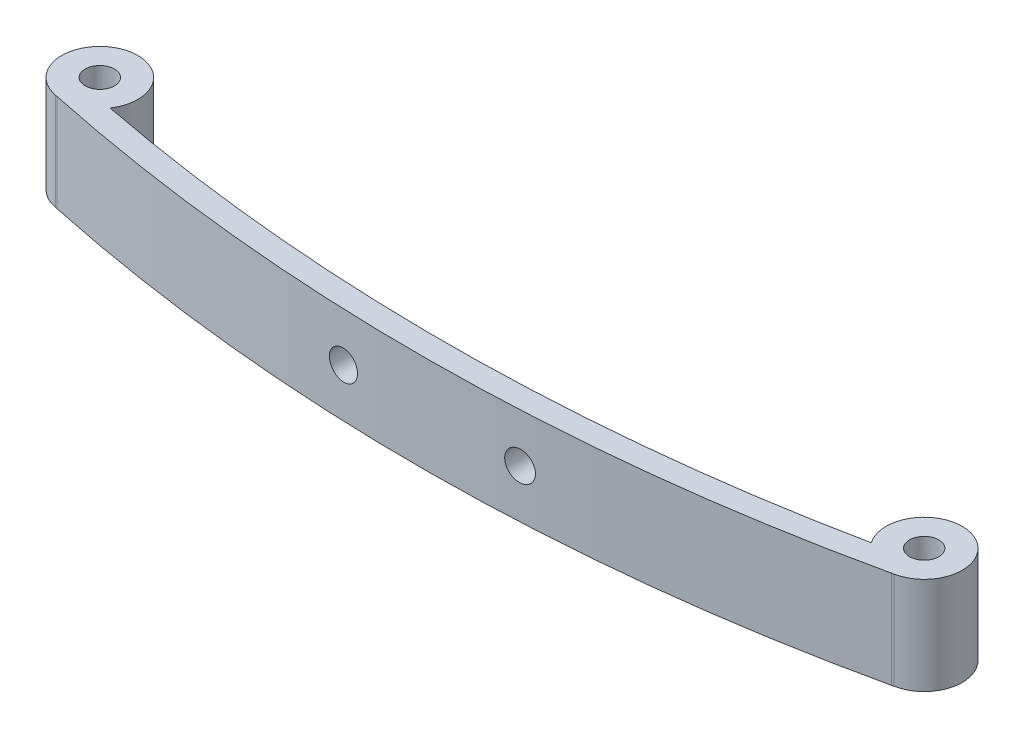
ISO-10303-21;
HEADER;
FILE_DESCRIPTION(('STEP AP214'),'2;1');
FILE_NAME('part.step','',(''),(''),'','','');
FILE_SCHEMA(('AUTOMOTIVE_DESIGN { 1 0 10303 214 1 1 1 1 }'));
ENDSEC;
DATA;
#1=APPLICATION_CONTEXT('core data for automotive mechanical design processes');
#2=APPLICATION_PROTOCOL_DEFINITION('international standard','automotive_design',2000,#1);
#3=PRODUCT_CONTEXT('',#1,'mechanical');
#4=PRODUCT('Part','Part','',(#3));
#5=PRODUCT_RELATED_PRODUCT_CATEGORY('part','',(#4));
#6=PRODUCT_DEFINITION_FORMATION('','',#4);
#7=PRODUCT_DEFINITION_CONTEXT('part definition',#1,'design');
#8=PRODUCT_DEFINITION('design','',#6,#7);
#9=PRODUCT_DEFINITION_SHAPE('','',#8);
#10=(LENGTH_UNIT() NAMED_UNIT(*) SI_UNIT(.MILLI.,.METRE.));
#11=(NAMED_UNIT(*) PLANE_ANGLE_UNIT() SI_UNIT($,.RADIAN.));
#12=(NAMED_UNIT(*) SI_UNIT($,.STERADIAN.) SOLID_ANGLE_UNIT());
#13=UNCERTAINTY_MEASURE_WITH_UNIT(LENGTH_MEASURE(1.E-05),#10,'distance_accuracy_value','');
#14=(GEOMETRIC_REPRESENTATION_CONTEXT(3) GLOBAL_UNCERTAINTY_ASSIGNED_CONTEXT((#13)) GLOBAL_UNIT_ASSIGNED_CONTEXT((#10,
#11,#12)) REPRESENTATION_CONTEXT('',''));
#15=CARTESIAN_POINT('',(0.,0.,0.));
#16=DIRECTION('',(0.,0.,1.));
#17=DIRECTION('',(1.,0.,0.));
#18=AXIS2_PLACEMENT_3D('',#15,#16,#17);
#19=CARTESIAN_POINT('',(-0.864955357142889,8.3,-164.510629845203));
#20=DIRECTION('',(0.,1.,0.));
#21=DIRECTION('',(0.,0.,1.));
#22=AXIS2_PLACEMENT_3D('',#19,#20,#21);
#23=PLANE('',#22);
#24=CARTESIAN_POINT('',(-35.,8.3,-4.14258073909656));
#25=DIRECTION('',(0.,1.,0.));
#26=DIRECTION('',(0.,0.,1.));
#27=AXIS2_PLACEMENT_3D('',#24,#25,#26);
#28=CIRCLE('',#27,1.25);
#29=CARTESIAN_POINT('',(-35.,8.3,-2.89258073909657));
#30=VERTEX_POINT('',#29);
#31=EDGE_CURVE('E136',#30,#30,#28,.T.);
#32=ORIENTED_EDGE('',*,*,#31,.F.);
#33=EDGE_LOOP('',(#32));
#34=FACE_BOUND('',#33,.T.);
#35=CARTESIAN_POINT('',(-0.864955357142889,8.3,-164.510629845203));
#36=DIRECTION('',(0.,-1.,0.));
#37=DIRECTION('',(0.,0.,1.));
#38=AXIS2_PLACEMENT_3D('',#35,#36,#37);
#39=CIRCLE('',#38,165.210703971618);
#40=CARTESIAN_POINT('',(32.3290587197964,8.3,-2.66893516717083));
#41=VERTEX_POINT('',#40);
#42=CARTESIAN_POINT('',(-32.3092176120712,8.3,-2.31989312438794));
#43=VERTEX_POINT('',#42);
#44=EDGE_CURVE('E143',#41,#43,#39,.T.);
#45=ORIENTED_EDGE('',*,*,#44,.T.);
#46=CARTESIAN_POINT('',(-35.,8.3,-4.14258073909656));
#47=DIRECTION('',(0.,1.,0.));
#48=DIRECTION('',(0.,0.,1.));
#49=AXIS2_PLACEMENT_3D('',#46,#47,#48);
#50=CIRCLE('',#49,3.25);
#51=CARTESIAN_POINT('',(-35.5757158370828,8.3,-0.943979283001734));
#52=VERTEX_POINT('',#51);
#53=EDGE_CURVE('E101',#43,#52,#50,.T.);
#54=ORIENTED_EDGE('',*,*,#53,.T.);
#55=DIRECTION('',(0.97628943196104,0.,0.216469270431603));
#56=VECTOR('',#55,1.);
#57=CARTESIAN_POINT('',(-35.413230424207,8.3,-0.907951955828518));
#58=LINE('',#57,#56);
#59=CARTESIAN_POINT('',(-35.413230424207,8.3,-0.907951955828545));
#60=VERTEX_POINT('',#59);
#61=EDGE_CURVE('E114',#52,#60,#58,.T.);
#62=ORIENTED_EDGE('',*,*,#61,.T.);
#63=CARTESIAN_POINT('',(-0.864955357142889,8.3,-164.510629845203));
#64=DIRECTION('',(0.,1.,0.));
#65=DIRECTION('',(0.,0.,1.));
#66=AXIS2_PLACEMENT_3D('',#63,#64,#65);
#67=CIRCLE('',#66,167.210703971618);
#68=CARTESIAN_POINT('',(35.4341722962853,8.3,-1.28749161325972));
#69=VERTEX_POINT('',#68);
#70=EDGE_CURVE('E108',#60,#69,#67,.T.);
#71=ORIENTED_EDGE('',*,*,#70,.T.);
#72=DIRECTION('',(0.974629450610067,0.,-0.223824560769186));
#73=VECTOR('',#72,1.);
#74=CARTESIAN_POINT('',(35.4341722962853,8.3,-1.28749161325972));
#75=LINE('',#74,#73);
#76=CARTESIAN_POINT('',(35.6227279714257,8.3,-1.33079359961198));
#77=VERTEX_POINT('',#76);
#78=EDGE_CURVE('E112',#69,#77,#75,.T.);
#79=ORIENTED_EDGE('',*,*,#78,.T.);
#80=CARTESIAN_POINT('',(35.,8.3,-4.52057570402037));
#81=DIRECTION('',(0.,1.,0.));
#82=DIRECTION('',(0.,0.,1.));
#83=AXIS2_PLACEMENT_3D('',#80,#81,#82);
#84=CIRCLE('',#83,3.25);
#85=EDGE_CURVE('E64',#77,#41,#84,.T.);
#86=ORIENTED_EDGE('',*,*,#85,.T.);
#87=EDGE_LOOP('',(#45,#54,#62,#71,#79,#86));
#88=FACE_BOUND('',#87,.T.);
#89=CARTESIAN_POINT('',(35.,8.3,-4.52057570402037));
#90=DIRECTION('',(0.,1.,0.));
#91=DIRECTION('',(0.,0.,1.));
#92=AXIS2_PLACEMENT_3D('',#89,#90,#91);
#93=CIRCLE('',#92,1.25);
#94=CARTESIAN_POINT('',(35.,8.3,-3.27057570402038));
#95=VERTEX_POINT('',#94);
#96=EDGE_CURVE('E181',#95,#95,#93,.T.);
#97=ORIENTED_EDGE('',*,*,#96,.F.);
#98=EDGE_LOOP('',(#97));
#99=FACE_BOUND('',#98,.T.);
#100=ADVANCED_FACE('F39',(#34,#88,#99),#23,.T.);
#101=CARTESIAN_POINT('',(-0.864955357142889,0.,-164.510629845203));
#102=DIRECTION('',(0.,1.,0.));
#103=DIRECTION('',(0.,0.,1.));
#104=AXIS2_PLACEMENT_3D('',#101,#102,#103);
#105=PLANE('',#104);
#106=CARTESIAN_POINT('',(-0.864955357142889,0.,-164.510629845203));
#107=DIRECTION('',(0.,-1.,0.));
#108=DIRECTION('',(0.,0.,1.));
#109=AXIS2_PLACEMENT_3D('',#106,#107,#108);
#110=CIRCLE('',#109,165.210703971618);
#111=CARTESIAN_POINT('',(32.3290587197964,0.,-2.66893516717083));
#112=VERTEX_POINT('',#111);
#113=CARTESIAN_POINT('',(-32.3092176120712,0.,-2.31989312438794));
#114=VERTEX_POINT('',#113);
#115=EDGE_CURVE('E132',#112,#114,#110,.T.);
#116=ORIENTED_EDGE('',*,*,#115,.F.);
#117=CARTESIAN_POINT('',(35.,0.,-4.52057570402037));
#118=DIRECTION('',(0.,1.,0.));
#119=DIRECTION('',(0.,0.,1.));
#120=AXIS2_PLACEMENT_3D('',#117,#118,#119);
#121=CIRCLE('',#120,3.25);
#122=CARTESIAN_POINT('',(35.6227279714257,0.,-1.33079359961198));
#123=VERTEX_POINT('',#122);
#124=EDGE_CURVE('E93',#123,#112,#121,.T.);
#125=ORIENTED_EDGE('',*,*,#124,.F.);
#126=DIRECTION('',(0.974629450610067,0.,-0.223824560769186));
#127=VECTOR('',#126,1.);
#128=CARTESIAN_POINT('',(35.4341722962853,0.,-1.28749161325972));
#129=LINE('',#128,#127);
#130=CARTESIAN_POINT('',(35.4341722962853,0.,-1.28749161325972));
#131=VERTEX_POINT('',#130);
#132=EDGE_CURVE('E87',#131,#123,#129,.T.);
#133=ORIENTED_EDGE('',*,*,#132,.F.);
#134=CARTESIAN_POINT('',(-0.864955357142889,0.,-164.510629845203));
#135=DIRECTION('',(0.,1.,0.));
#136=DIRECTION('',(0.,0.,1.));
#137=AXIS2_PLACEMENT_3D('',#134,#135,#136);
#138=CIRCLE('',#137,167.210703971618);
#139=CARTESIAN_POINT('',(-35.413230424207,0.,-0.907951955828545));
#140=VERTEX_POINT('',#139);
#141=EDGE_CURVE('E122',#140,#131,#138,.T.);
#142=ORIENTED_EDGE('',*,*,#141,.F.);
#143=DIRECTION('',(0.97628943196104,0.,0.216469270431603));
#144=VECTOR('',#143,1.);
#145=CARTESIAN_POINT('',(-35.413230424207,0.,-0.907951955828518));
#146=LINE('',#145,#144);
#147=CARTESIAN_POINT('',(-35.5757158370828,0.,-0.943979283001734));
#148=VERTEX_POINT('',#147);
#149=EDGE_CURVE('E138',#148,#140,#146,.T.);
#150=ORIENTED_EDGE('',*,*,#149,.F.);
#151=CARTESIAN_POINT('',(-35.,0.,-4.14258073909656));
#152=DIRECTION('',(0.,1.,0.));
#153=DIRECTION('',(0.,0.,1.));
#154=AXIS2_PLACEMENT_3D('',#151,#152,#153);
#155=CIRCLE('',#154,3.25);
#156=EDGE_CURVE('E135',#114,#148,#155,.T.);
#157=ORIENTED_EDGE('',*,*,#156,.F.);
#158=EDGE_LOOP('',(#116,#125,#133,#142,#150,#157));
#159=FACE_BOUND('',#158,.T.);
#160=CARTESIAN_POINT('',(-35.,0.,-4.14258073909656));
#161=DIRECTION('',(0.,1.,0.));
#162=DIRECTION('',(0.,0.,1.));
#163=AXIS2_PLACEMENT_3D('',#160,#161,#162);
#164=CIRCLE('',#163,1.25);
#165=CARTESIAN_POINT('',(-35.,0.,-2.89258073909657));
#166=VERTEX_POINT('',#165);
#167=EDGE_CURVE('E184',#166,#166,#164,.T.);
#168=ORIENTED_EDGE('',*,*,#167,.T.);
#169=EDGE_LOOP('',(#168));
#170=FACE_BOUND('',#169,.T.);
#171=CARTESIAN_POINT('',(35.,0.,-4.52057570402037));
#172=DIRECTION('',(0.,1.,0.));
#173=DIRECTION('',(0.,0.,1.));
#174=AXIS2_PLACEMENT_3D('',#171,#172,#173);
#175=CIRCLE('',#174,1.25);
#176=CARTESIAN_POINT('',(35.,0.,-3.27057570402038));
#177=VERTEX_POINT('',#176);
#178=EDGE_CURVE('E180',#177,#177,#175,.T.);
#179=ORIENTED_EDGE('',*,*,#178,.T.);
#180=EDGE_LOOP('',(#179));
#181=FACE_BOUND('',#180,.T.);
#182=ADVANCED_FACE('F200',(#159,#170,#181),#105,.F.);
#183=CARTESIAN_POINT('',(-0.864955357142889,8.3,-164.510629845203));
#184=DIRECTION('',(0.,-1.,0.));
#185=DIRECTION('',(0.,0.,-1.));
#186=AXIS2_PLACEMENT_3D('',#183,#184,#185);
#187=CYLINDRICAL_SURFACE('',#186,165.210703971618);
#188=CARTESIAN_POINT('',(8.75523546801958,4.15,0.41974526891872));
#189=CARTESIAN_POINT('',(8.75523234367771,4.22012775691496,0.419745491554456));
#190=CARTESIAN_POINT('',(8.7493140129362,4.2903063866926,0.420090990830751));
#191=CARTESIAN_POINT('',(8.72578859372263,4.42872911081155,0.421460636690887));
#192=CARTESIAN_POINT('',(8.70816743840692,4.49697077385119,0.422485599990574));
#193=CARTESIAN_POINT('',(8.66174382480419,4.62949238087325,0.425173566201312));
#194=CARTESIAN_POINT('',(8.63294714461795,4.69377435227299,0.426836239390938));
#195=CARTESIAN_POINT('',(8.56500291570541,4.81657067320099,0.430734724263326));
#196=CARTESIAN_POINT('',(8.52585789764512,4.87508642805016,0.432970395816375));
#197=CARTESIAN_POINT('',(8.43828867001005,4.98476982495955,0.437932672337795));
#198=CARTESIAN_POINT('',(8.38985599940334,5.03593069179741,0.440659724815337));
#199=CARTESIAN_POINT('',(8.28510948695568,5.12939981296102,0.446503270882601));
#200=CARTESIAN_POINT('',(8.22879527493013,5.1717076512398,0.449619782763931));
#201=CARTESIAN_POINT('',(8.10979143930163,5.24633590146088,0.45613704390323));
#202=CARTESIAN_POINT('',(8.04709214420073,5.27864085376892,0.459538222916373));
#203=CARTESIAN_POINT('',(7.91716826779515,5.33226495035966,0.466505660058124));
#204=CARTESIAN_POINT('',(7.84994366214295,5.35358403552979,0.470071919074879));
#205=CARTESIAN_POINT('',(7.71279154477582,5.38465389005854,0.477259659800095));
#206=CARTESIAN_POINT('',(7.6428609508304,5.39439104119409,0.480881201455498));
#207=CARTESIAN_POINT('',(7.50235497855954,5.40197507513718,0.488066429431124));
#208=CARTESIAN_POINT('',(7.4317795997323,5.39982194869035,0.491630115706314));
#209=CARTESIAN_POINT('',(7.29196756282965,5.38368151981341,0.498600856959138));
#210=CARTESIAN_POINT('',(7.2227312745681,5.36969099469107,0.502007869016394));
#211=CARTESIAN_POINT('',(7.08758566731119,5.33026408498481,0.508576243457887));
#212=CARTESIAN_POINT('',(7.02167634432059,5.30482771414616,0.511737606137118));
#213=CARTESIAN_POINT('',(6.89509912252421,5.24324484304104,0.517738255939391));
#214=CARTESIAN_POINT('',(6.83442816188194,5.2071046546717,0.520577731514248));
#215=CARTESIAN_POINT('',(6.72001377975751,5.12513046151643,0.525875920481087));
#216=CARTESIAN_POINT('',(6.6662703199565,5.07929651035439,0.528334635979225));
#217=CARTESIAN_POINT('',(6.56729686844673,4.97928617943602,0.532821376474635));
#218=CARTESIAN_POINT('',(6.52205816339034,4.92511844250437,0.534849842550244));
#219=CARTESIAN_POINT('',(6.44131745101904,4.80994279108891,0.53844383631376));
#220=CARTESIAN_POINT('',(6.40581539141347,4.74893491334256,0.54000936648787));
#221=CARTESIAN_POINT('',(6.34559332504817,4.62187687823517,0.54265126930583));
#222=CARTESIAN_POINT('',(6.32086252862733,4.55583184494836,0.543728131497863));
#223=CARTESIAN_POINT('',(6.28283757600977,4.42052173500274,0.545379219315388));
#224=CARTESIAN_POINT('',(6.26954337213898,4.35125667176806,0.545953447036141));
#225=CARTESIAN_POINT('',(6.25477644190879,4.21152194369805,0.546591086545572));
#226=CARTESIAN_POINT('',(6.25329588598813,4.14105310771492,0.546654836656242));
#227=CARTESIAN_POINT('',(6.26217788761156,4.00086729392074,0.546271547983102));
#228=CARTESIAN_POINT('',(6.27254042347998,3.93115031473385,0.545824510134156));
#229=CARTESIAN_POINT('',(6.30480977715857,3.79446002038941,0.544425917333555));
#230=CARTESIAN_POINT('',(6.32671451735362,3.72748621379392,0.543474453179248));
#231=CARTESIAN_POINT('',(6.38144211469525,3.59816844412159,0.541080768086543));
#232=CARTESIAN_POINT('',(6.4142649785184,3.53582448387598,0.539638546848042));
#233=CARTESIAN_POINT('',(6.48990602173823,3.41751275913382,0.536285149030597));
#234=CARTESIAN_POINT('',(6.53272751484578,3.36154711768794,0.534373816969817));
#235=CARTESIAN_POINT('',(6.62714041042641,3.257599379909,0.530114926661906));
#236=CARTESIAN_POINT('',(6.67873184655798,3.20961731421781,0.527767366740558));
#237=CARTESIAN_POINT('',(6.78926149618302,3.12295724190971,0.522678091077079));
#238=CARTESIAN_POINT('',(6.84820545871927,3.08428658612228,0.519936066637596));
#239=CARTESIAN_POINT('',(6.97173301782925,3.01738849182913,0.514116300395867));
#240=CARTESIAN_POINT('',(7.0363166398803,2.98916110050416,0.511038557076984));
#241=CARTESIAN_POINT('',(7.16936208213937,2.94391906611331,0.504614561530486));
#242=CARTESIAN_POINT('',(7.23782791441387,2.92691626117345,0.501268029980191));
#243=CARTESIAN_POINT('',(7.37663371301743,2.90464766967319,0.494393542668509));
#244=CARTESIAN_POINT('',(7.44697369404434,2.89938197518744,0.490865585484106));
#245=CARTESIAN_POINT('',(7.58760200130654,2.90073423451941,0.483721398905784));
#246=CARTESIAN_POINT('',(7.65789021504032,2.90736347919335,0.480105088860304));
#247=CARTESIAN_POINT('',(7.79635468897041,2.93233884260768,0.472894251458949));
#248=CARTESIAN_POINT('',(7.86453093753108,2.95068502588915,0.469299724223171));
#249=CARTESIAN_POINT('',(7.99686289087432,2.99858525081672,0.462244531146737));
#250=CARTESIAN_POINT('',(8.06101703624891,3.02814360859774,0.458783917422253));
#251=CARTESIAN_POINT('',(8.18344997043051,3.09763154156223,0.452113922680006));
#252=CARTESIAN_POINT('',(8.24172899851644,3.13756069413193,0.448904531431768));
#253=CARTESIAN_POINT('',(8.35071784684562,3.22663140626683,0.442851648466624));
#254=CARTESIAN_POINT('',(8.4014326748975,3.27576682185215,0.44000791484301));
#255=CARTESIAN_POINT('',(8.49390354221656,3.38189250945195,0.434787242240552));
#256=CARTESIAN_POINT('',(8.535657411412,3.43888467865759,0.432410416344335));
#257=CARTESIAN_POINT('',(8.60896038366011,3.55903345604726,0.428216332520746));
#258=CARTESIAN_POINT('',(8.64051852487354,3.62218453954559,0.426398579064002));
#259=CARTESIAN_POINT('',(8.69254686909989,3.75285329662178,0.423391944263031));
#260=CARTESIAN_POINT('',(8.71303050005948,3.82036557046379,0.422202301370124));
#261=CARTESIAN_POINT('',(8.73684790490841,3.93192653704009,0.420817000107771));
#262=CARTESIAN_POINT('',(8.74373455060982,3.97524634074798,0.420415766646807));
#263=CARTESIAN_POINT('',(8.75292930616206,4.06237080749051,0.419879831617554));
#264=CARTESIAN_POINT('',(8.75523742049632,4.10617547005032,0.419745129788268));
#265=CARTESIAN_POINT('',(8.75523546801958,4.15,0.41974526891872));
#266=B_SPLINE_CURVE_WITH_KNOTS('',3,(#188,#189,#190,#191,#192,#193,#194,#195,#196,#197,#198,
#199,#200,#201,#202,#203,#204,#205,#206,#207,#208,#209,#210,#211,#212,#213,#214,#215,#216,#217,
#218,#219,#220,#221,#222,#223,#224,#225,#226,#227,#228,#229,#230,#231,#232,#233,#234,#235,#236,
#237,#238,#239,#240,#241,#242,#243,#244,#245,#246,#247,#248,#249,#250,#251,#252,#253,#254,#255,
#256,#257,#258,#259,#260,#261,#262,#263,#264,#265),.UNSPECIFIED.,.T.,.F.,(4,2,2,2,2,2,2,2,2,2,2,
2,2,2,2,2,2,2,2,2,2,2,2,2,2,2,2,2,2,2,2,2,2,2,2,2,2,2,4),(0.,0.210223162273476,
0.420699472105275,0.631067103680404,0.841383337771128,1.05189208761873,1.26241072807794,
1.4732531232293,1.68409665286589,1.89518785139276,2.10627921421473,2.31742806445294,
2.52857666112368,2.73960099337464,2.95062415831329,3.16142993192407,3.37223457337985,
3.58282756172663,3.7934196722006,4.00387219997306,4.2143243425681,4.42473861637718,
4.63515301885741,4.8456372553737,5.05612229973341,5.26677296926159,5.47742459045928,
5.68829802413861,5.89917311206057,6.11024847170822,6.32132499404439,6.53248285304027,
6.74363210862383,6.95464094832168,7.16570083042665,7.37657309857563,7.58718910542907,
7.71856276827032,7.84993630246649),.UNSPECIFIED.);
#267=CARTESIAN_POINT('',(8.75523546801958,4.15,0.41974526891872));
#268=VERTEX_POINT('',#267);
#269=EDGE_CURVE('E174',#268,#268,#266,.T.);
#270=ORIENTED_EDGE('',*,*,#269,.T.);
#271=EDGE_LOOP('',(#270));
#272=FACE_BOUND('',#271,.T.);
#273=CARTESIAN_POINT('',(-6.24476453198042,4.15,0.61245866769935));
#274=CARTESIAN_POINT('',(-6.24476764768577,4.22018360799957,0.612458606573658));
#275=CARTESIAN_POINT('',(-6.2506953010656,4.29041808996733,0.612265770116205));
#276=CARTESIAN_POINT('',(-6.27425905692377,4.42895231746688,0.611495485977878));
#277=CARTESIAN_POINT('',(-6.29190924491371,4.497249632279,0.610917575598852));
#278=CARTESIAN_POINT('',(-6.33841377636479,4.6298820691541,0.609382563660205));
#279=CARTESIAN_POINT('',(-6.36726266776337,4.69421910163959,0.608425646614495));
#280=CARTESIAN_POINT('',(-6.43533606625281,4.81711723970539,0.60614313592235));
#281=CARTESIAN_POINT('',(-6.47455800057068,4.87567977256776,0.604817633690034));
#282=CARTESIAN_POINT('',(-6.56227848115715,4.98540692572473,0.601814073459906));
#283=CARTESIAN_POINT('',(-6.61077985440873,5.03656928319194,0.600135908007802));
#284=CARTESIAN_POINT('',(-6.71567453205909,5.13002724983261,0.596452196119219));
#285=CARTESIAN_POINT('',(-6.77206816300177,5.17232249194623,0.594446636136147));
#286=CARTESIAN_POINT('',(-6.89117358777328,5.24686649539246,0.590142255155237));
#287=CARTESIAN_POINT('',(-6.95388849684398,5.27911027082593,0.587843289411626));
#288=CARTESIAN_POINT('',(-7.08383208059165,5.33261216168597,0.582999656758561));
#289=CARTESIAN_POINT('',(-7.15106076259404,5.35387025928335,0.580454989450354));
#290=CARTESIAN_POINT('',(-7.28817028578425,5.38481219158038,0.5751773096252));
#291=CARTESIAN_POINT('',(-7.35805284066948,5.39448841169088,0.572444174445956));
#292=CARTESIAN_POINT('',(-7.49844585803743,5.40196966364717,0.566862398106028));
#293=CARTESIAN_POINT('',(-7.568956321709,5.39977467301157,0.564013756726611));
#294=CARTESIAN_POINT('',(-7.70864507353955,5.38357273188965,0.558281547366208));
#295=CARTESIAN_POINT('',(-7.77782260448696,5.369559258806,0.555397960965485));
#296=CARTESIAN_POINT('',(-7.91284266673113,5.33010905553934,0.549688100359515));
#297=CARTESIAN_POINT('',(-7.97868518865661,5.30467229325921,0.546861826315328));
#298=CARTESIAN_POINT('',(-8.10517373868071,5.24309151777392,0.541361833708983));
#299=CARTESIAN_POINT('',(-8.16581913996236,5.20694621536436,0.538688133561491));
#300=CARTESIAN_POINT('',(-8.28018042223605,5.12497250539288,0.533589762293989));
#301=CARTESIAN_POINT('',(-8.333896319487,5.07914412055134,0.531165090589679));
#302=CARTESIAN_POINT('',(-8.43284346162954,4.97912834642317,0.526657559583951));
#303=CARTESIAN_POINT('',(-8.47807903111339,4.92494524350744,0.524574526130325));
#304=CARTESIAN_POINT('',(-8.55880935877245,4.80973931783301,0.520830658354493));
#305=CARTESIAN_POINT('',(-8.59430416758756,4.74871653063453,0.51916982183739));
#306=CARTESIAN_POINT('',(-8.65450878451524,4.62162748766805,0.516339090544947));
#307=CARTESIAN_POINT('',(-8.67922916052254,4.5555662488542,0.515168714754271));
#308=CARTESIAN_POINT('',(-8.71722886753176,4.42022437094517,0.513364993445503));
#309=CARTESIAN_POINT('',(-8.73050826584511,4.35094375079329,0.512731644767886));
#310=CARTESIAN_POINT('',(-8.74523910935073,4.21119841107628,0.512028872668545));
#311=CARTESIAN_POINT('',(-8.74670147821483,4.14073484543401,0.511958928435476));
#312=CARTESIAN_POINT('',(-8.73778521208701,4.00056278292951,0.512384537772931));
#313=CARTESIAN_POINT('',(-8.72740660847319,3.93085428406689,0.512880089844912));
#314=CARTESIAN_POINT('',(-8.69510993488081,3.79419186950748,0.514415661952013));
#315=CARTESIAN_POINT('',(-8.67319524082284,3.72723715412053,0.515455522700184));
#316=CARTESIAN_POINT('',(-8.61845381955216,3.59795849519661,0.518036497642598));
#317=CARTESIAN_POINT('',(-8.58562707080556,3.53563456079833,0.519577612826019));
#318=CARTESIAN_POINT('',(-8.50997629252132,3.4173498316714,0.523099406914521));
#319=CARTESIAN_POINT('',(-8.4671469843983,3.3613924199747,0.525080317882822));
#320=CARTESIAN_POINT('',(-8.37271852774415,3.25746064161344,0.529402955656526));
#321=CARTESIAN_POINT('',(-8.32111932855012,3.20948632106967,0.531744684546336));
#322=CARTESIAN_POINT('',(-8.21055915162095,3.12283098524176,0.536702368814359));
#323=CARTESIAN_POINT('',(-8.15159079796905,3.08415939628049,0.539318598518416));
#324=CARTESIAN_POINT('',(-8.02800645590947,3.01726431362935,0.544728221132896));
#325=CARTESIAN_POINT('',(-7.96339044374867,2.98904086388524,0.547521614788427));
#326=CARTESIAN_POINT('',(-7.83028265818978,2.9438190114173,0.553192235935202));
#327=CARTESIAN_POINT('',(-7.7617875162583,2.92683053227457,0.556069535202776));
#328=CARTESIAN_POINT('',(-7.62291621998967,2.90459964323533,0.561813341153982));
#329=CARTESIAN_POINT('',(-7.55254005766644,2.89935728321633,0.564679847791733));
#330=CARTESIAN_POINT('',(-7.41188077162681,2.900768804557,0.570318268929195));
#331=CARTESIAN_POINT('',(-7.34159768448626,2.90742645846741,0.57309015314773));
#332=CARTESIAN_POINT('',(-7.20314313344426,2.93245902871143,0.578463932209329));
#333=CARTESIAN_POINT('',(-7.13497167178399,2.95083395748076,0.581065826871978));
#334=CARTESIAN_POINT('',(-7.00269614816228,2.99877619798754,0.586036468414912));
#335=CARTESIAN_POINT('',(-6.93859102162399,3.02834056606296,0.588405276408146));
#336=CARTESIAN_POINT('',(-6.81625503280144,3.09782460442871,0.592860397934622));
#337=CARTESIAN_POINT('',(-6.75802392257719,3.13774383738992,0.594946723392618));
#338=CARTESIAN_POINT('',(-6.64913113301011,3.2267736646842,0.59879747272436));
#339=CARTESIAN_POINT('',(-6.59846403095467,3.27587761694826,0.600562127409639));
#340=CARTESIAN_POINT('',(-6.50608013595014,3.38191900412738,0.603744335097544));
#341=CARTESIAN_POINT('',(-6.46436554080351,3.4388583569823,0.605161802879296));
#342=CARTESIAN_POINT('',(-6.39109870854648,3.55892531442362,0.607630181775628));
#343=CARTESIAN_POINT('',(-6.3595449049291,3.62205196314448,0.608681149396254));
#344=CARTESIAN_POINT('',(-6.30751880003737,3.75266176959088,0.610404229774605));
#345=CARTESIAN_POINT('',(-6.2870331803701,3.82013958155532,0.611076797902529));
#346=CARTESIAN_POINT('',(-6.26318937837624,3.93170687096492,0.611857581528951));
#347=CARTESIAN_POINT('',(-6.25628871271416,3.97507039631148,0.612082865842311));
#348=CARTESIAN_POINT('',(-6.24707531634483,4.062282655807,0.612383428012264));
#349=CARTESIAN_POINT('',(-6.24476258449343,4.10613138983495,0.612458705906266));
#350=CARTESIAN_POINT('',(-6.24476453198042,4.15,0.61245866769935));
#351=B_SPLINE_CURVE_WITH_KNOTS('',3,(#273,#274,#275,#276,#277,#278,#279,#280,#281,#282,#283,
#284,#285,#286,#287,#288,#289,#290,#291,#292,#293,#294,#295,#296,#297,#298,#299,#300,#301,#302,
#303,#304,#305,#306,#307,#308,#309,#310,#311,#312,#313,#314,#315,#316,#317,#318,#319,#320,#321,
#322,#323,#324,#325,#326,#327,#328,#329,#330,#331,#332,#333,#334,#335,#336,#337,#338,#339,#340,
#341,#342,#343,#344,#345,#346,#347,#348,#349,#350),.UNSPECIFIED.,.T.,.F.,(4,2,2,2,2,2,2,2,2,2,2,
2,2,2,2,2,2,2,2,2,2,2,2,2,2,2,2,2,2,2,2,2,2,2,2,2,2,2,4),(0.,0.210390669820322,
0.421034598403308,0.63157610383944,0.842065438631397,1.05261900144725,1.2631812785404,
1.47384783671978,1.68451473679911,1.89532006541143,2.10612579324162,2.31704794053302,
2.52797068047636,2.73891882379848,2.94986647215764,3.16070625216525,3.37154493604612,
3.5821763549291,3.79280653458249,4.00324198522386,4.21367687822118,4.4240502237742,
4.63442398448108,4.84490901622756,5.05539526396902,5.26609390435201,5.47679343094129,
5.68767881570359,5.89856509594632,6.10951824336319,6.32047161466818,6.5313695279413,
6.74225853556586,6.95299562113974,7.16378438274428,7.37454063110102,7.58504270753533,
7.71654846566709,7.84805419100348),.UNSPECIFIED.);
#352=CARTESIAN_POINT('',(-6.24476453198042,4.15,0.61245866769935));
#353=VERTEX_POINT('',#352);
#354=EDGE_CURVE('E154',#353,#353,#351,.T.);
#355=ORIENTED_EDGE('',*,*,#354,.T.);
#356=EDGE_LOOP('',(#355));
#357=FACE_BOUND('',#356,.T.);
#358=ORIENTED_EDGE('',*,*,#115,.T.);
#359=DIRECTION('',(0.,-1.,0.));
#360=VECTOR('',#359,1.);
#361=CARTESIAN_POINT('',(-32.3092176120712,8.3,-2.31989312438794));
#362=LINE('',#361,#360);
#363=EDGE_CURVE('E11',#43,#114,#362,.T.);
#364=ORIENTED_EDGE('',*,*,#363,.F.);
#365=ORIENTED_EDGE('',*,*,#44,.F.);
#366=DIRECTION('',(0.,-1.,0.));
#367=VECTOR('',#366,1.);
#368=CARTESIAN_POINT('',(32.3290587197964,8.3,-2.66893516717083));
#369=LINE('',#368,#367);
#370=EDGE_CURVE('E128',#41,#112,#369,.T.);
#371=ORIENTED_EDGE('',*,*,#370,.T.);
#372=EDGE_LOOP('',(#358,#364,#365,#371));
#373=FACE_BOUND('',#372,.T.);
#374=ADVANCED_FACE('F41',(#272,#357,#373),#187,.F.);
#375=CARTESIAN_POINT('',(-35.,8.3,-4.14258073909656));
#376=DIRECTION('',(0.,-1.,0.));
#377=DIRECTION('',(0.,0.,-1.));
#378=AXIS2_PLACEMENT_3D('',#375,#376,#377);
#379=CYLINDRICAL_SURFACE('',#378,3.25);
#380=ORIENTED_EDGE('',*,*,#156,.T.);
#381=DIRECTION('',(0.,-1.,0.));
#382=VECTOR('',#381,1.);
#383=CARTESIAN_POINT('',(-35.5757158370828,8.3,-0.943979283001734));
#384=LINE('',#383,#382);
#385=EDGE_CURVE('E55',#52,#148,#384,.T.);
#386=ORIENTED_EDGE('',*,*,#385,.F.);
#387=ORIENTED_EDGE('',*,*,#53,.F.);
#388=ORIENTED_EDGE('',*,*,#363,.T.);
#389=EDGE_LOOP('',(#380,#386,#387,#388));
#390=FACE_BOUND('',#389,.T.);
#391=ADVANCED_FACE('F194',(#390),#379,.T.);
#392=CARTESIAN_POINT('',(-35.413230424207,8.3,-0.907951955828518));
#393=DIRECTION('',(0.216469270431603,0.,-0.97628943196104));
#394=DIRECTION('',(-0.97628943196104,0.,-0.216469270431603));
#395=AXIS2_PLACEMENT_3D('',#392,#393,#394);
#396=PLANE('',#395);
#397=ORIENTED_EDGE('',*,*,#149,.T.);
#398=DIRECTION('',(0.,-1.,0.));
#399=VECTOR('',#398,1.);
#400=CARTESIAN_POINT('',(-35.413230424207,8.3,-0.907951955828545));
#401=LINE('',#400,#399);
#402=EDGE_CURVE('E123',#60,#140,#401,.T.);
#403=ORIENTED_EDGE('',*,*,#402,.F.);
#404=ORIENTED_EDGE('',*,*,#61,.F.);
#405=ORIENTED_EDGE('',*,*,#385,.T.);
#406=EDGE_LOOP('',(#397,#403,#404,#405));
#407=FACE_BOUND('',#406,.T.);
#408=ADVANCED_FACE('F197',(#407),#396,.F.);
#409=CARTESIAN_POINT('',(-0.864955357142889,8.3,-164.510629845203));
#410=DIRECTION('',(0.,-1.,0.));
#411=DIRECTION('',(0.,0.,-1.));
#412=AXIS2_PLACEMENT_3D('',#409,#410,#411);
#413=CYLINDRICAL_SURFACE('',#412,167.210703971618);
#414=CARTESIAN_POINT('',(8.75523546801958,4.15,2.42310386722372));
#415=CARTESIAN_POINT('',(8.75523234393409,4.07987021372099,2.4231040871745));
#416=CARTESIAN_POINT('',(8.74931367427641,4.00968955370264,2.42344545968196));
#417=CARTESIAN_POINT('',(8.72578686387223,3.87126278266572,2.42479874861225));
#418=CARTESIAN_POINT('',(8.708164655379,3.80301910297613,2.4258114720015));
#419=CARTESIAN_POINT('',(8.66173811387968,3.67049349362039,2.42846734802699));
#420=CARTESIAN_POINT('',(8.63293954899056,3.60620954013766,2.43011017546145));
#421=CARTESIAN_POINT('',(8.56499064879712,3.48340953715238,2.43396214071584));
#422=CARTESIAN_POINT('',(8.52584284540266,3.42489208169377,2.43617114001951));
#423=CARTESIAN_POINT('',(8.43826797252982,3.31520689088853,2.44107418222038));
#424=CARTESIAN_POINT('',(8.38983261938769,3.26404578857397,2.44376865798866));
#425=CARTESIAN_POINT('',(8.28508020558082,3.17057671654628,2.44954240470818));
#426=CARTESIAN_POINT('',(8.22876277614541,3.12826916128627,2.45262169366257));
#427=CARTESIAN_POINT('',(8.10975432809807,3.05364363890487,2.45906099642495));
#428=CARTESIAN_POINT('',(8.04705387064028,3.02134075979767,2.46242142461832));
#429=CARTESIAN_POINT('',(7.91712783807551,2.96772095411992,2.46930537268909));
#430=CARTESIAN_POINT('',(7.84990223941741,2.94640408473109,2.47282889341527));
#431=CARTESIAN_POINT('',(7.71275037431824,2.91533928374505,2.47993038214875));
#432=CARTESIAN_POINT('',(7.64282109942733,2.90560464623511,2.48350840795742));
#433=CARTESIAN_POINT('',(7.50231823367187,2.89802510421588,2.49060728374273));
#434=CARTESIAN_POINT('',(7.43174464234576,2.90018020822446,2.49412813367841));
#435=CARTESIAN_POINT('',(7.29193707433314,2.91632387996302,2.50101504687116));
#436=CARTESIAN_POINT('',(7.22270345869407,2.93031559280553,2.50438106873812));
#437=CARTESIAN_POINT('',(7.08756346510807,2.96974392017249,2.51087040703797));
#438=CARTESIAN_POINT('',(7.02165708334386,2.99518052156609,2.51399372374932));
#439=CARTESIAN_POINT('',(6.89508489662199,3.05676321306135,2.51992219340365));
#440=CARTESIAN_POINT('',(6.834416102449,3.09290314163335,2.52272752811649));
#441=CARTESIAN_POINT('',(6.72000600375099,3.17487595375888,2.52796200944081));
#442=CARTESIAN_POINT('',(6.66626466175541,3.22070878488,2.53039115808711));
#443=CARTESIAN_POINT('',(6.56729389686175,3.32071724513383,2.53482400202353));
#444=CARTESIAN_POINT('',(6.52205596831894,3.37488443799597,2.53682812271332));
#445=CARTESIAN_POINT('',(6.44131669160088,3.49005854295913,2.54037898136648));
#446=CARTESIAN_POINT('',(6.40581529241468,3.55106541922381,2.54192572172612));
#447=CARTESIAN_POINT('',(6.3455935156642,3.67812259602396,2.54453595272748));
#448=CARTESIAN_POINT('',(6.32086260559468,3.74416789483442,2.5455999155222));
#449=CARTESIAN_POINT('',(6.2828375286557,3.8794784198371,2.54723122351512));
#450=CARTESIAN_POINT('',(6.26954331523637,3.94874363292235,2.54779857073464));
#451=CARTESIAN_POINT('',(6.25477629157968,4.08847971243055,2.54842857348637));
#452=CARTESIAN_POINT('',(6.25329583815287,4.1589497697671,2.54849155532969));
#453=CARTESIAN_POINT('',(6.26217845300096,4.29913799703031,2.54811283337948));
#454=CARTESIAN_POINT('',(6.27254150012781,4.36885616829934,2.54767113048713));
#455=CARTESIAN_POINT('',(6.30481238105322,4.50554908716487,2.54628923130977));
#456=CARTESIAN_POINT('',(6.32671818666046,4.57252431449974,2.54534912260005));
#457=CARTESIAN_POINT('',(6.38144849261314,4.70184476817846,2.54298400336271));
#458=CARTESIAN_POINT('',(6.41427299944246,4.76418999177284,2.54155899254715));
#459=CARTESIAN_POINT('',(6.48991764752588,4.88250349391281,2.53824561957326));
#460=CARTESIAN_POINT('',(6.53274102386597,4.93846969981805,2.53635710744119));
#461=CARTESIAN_POINT('',(6.62715818508893,5.04241824496493,2.53214906035685));
#462=CARTESIAN_POINT('',(6.67875200291796,5.09040055421372,2.52982952378544));
#463=CARTESIAN_POINT('',(6.78928586530496,5.17705979715013,2.52480104072049));
#464=CARTESIAN_POINT('',(6.84823152258662,5.2157295543912,2.52209179646172));
#465=CARTESIAN_POINT('',(6.97176267522426,5.28262554334392,2.51634160399607));
#466=CARTESIAN_POINT('',(7.03634819531376,5.31085172925262,2.5133006543345));
#467=CARTESIAN_POINT('',(7.16939587643223,5.35609032306653,2.50695353829952));
#468=CARTESIAN_POINT('',(7.23786195411499,5.37309117422248,2.50364710251635));
#469=CARTESIAN_POINT('',(7.37666812097241,5.39535587496249,2.4968549921724));
#470=CARTESIAN_POINT('',(7.44700822457516,5.40061963415651,2.49336931623146));
#471=CARTESIAN_POINT('',(7.58763495419046,5.39926350448543,2.48631084758957));
#472=CARTESIAN_POINT('',(7.6579214701767,5.39263259448291,2.48273797712353));
#473=CARTESIAN_POINT('',(7.79638232953215,5.36765445972989,2.47561377944634));
#474=CARTESIAN_POINT('',(7.86455666144166,5.34930717142361,2.47206245235217));
#475=CARTESIAN_POINT('',(7.99688399966966,5.30140559871852,2.46509210597211));
#476=CARTESIAN_POINT('',(8.06103548215499,5.27184709710112,2.46167313700816));
#477=CARTESIAN_POINT('',(8.18346310020375,5.20235983144462,2.45508342885862));
#478=CARTESIAN_POINT('',(8.24173947484218,5.16243148962072,2.45191267957343));
#479=CARTESIAN_POINT('',(8.3507239704937,5.07336284405367,2.445932647814));
#480=CARTESIAN_POINT('',(8.40143699929149,5.02422856108074,2.44312313110397));
#481=CARTESIAN_POINT('',(8.49390454754776,4.91810599082919,2.43796528186717));
#482=CARTESIAN_POINT('',(8.53565689557396,4.86111580532052,2.43561706113742));
#483=CARTESIAN_POINT('',(8.60895860285928,4.74096982416913,2.4314733761217));
#484=CARTESIAN_POINT('',(8.64051666920306,4.67781935047058,2.42967744018456));
#485=CARTESIAN_POINT('',(8.69254500346459,4.54715215755676,2.42670688669826));
#486=CARTESIAN_POINT('',(8.71302869591232,4.47964083632493,2.42553151692976));
#487=CARTESIAN_POINT('',(8.73684685127319,4.36807967560475,2.42416279734726));
#488=CARTESIAN_POINT('',(8.74373389361009,4.32475863097923,2.42376635621305));
#489=CARTESIAN_POINT('',(8.75292917595242,4.23763167983014,2.42323682255091));
#490=CARTESIAN_POINT('',(8.75523742033501,4.19382577377013,2.42310372977123));
#491=CARTESIAN_POINT('',(8.75523546801958,4.15,2.42310386722372));
#492=B_SPLINE_CURVE_WITH_KNOTS('',3,(#414,#415,#416,#417,#418,#419,#420,#421,#422,#423,#424,
#425,#426,#427,#428,#429,#430,#431,#432,#433,#434,#435,#436,#437,#438,#439,#440,#441,#442,#443,
#444,#445,#446,#447,#448,#449,#450,#451,#452,#453,#454,#455,#456,#457,#458,#459,#460,#461,#462,
#463,#464,#465,#466,#467,#468,#469,#470,#471,#472,#473,#474,#475,#476,#477,#478,#479,#480,#481,
#482,#483,#484,#485,#486,#487,#488,#489,#490,#491),.UNSPECIFIED.,.T.,.F.,(4,2,2,2,2,2,2,2,2,2,2,
2,2,2,2,2,2,2,2,2,2,2,2,2,2,2,2,2,2,2,2,2,2,2,2,2,2,2,4),(0.,0.210229249381413,
0.420711654453406,0.631085573719977,0.841408073196732,1.05191904149802,1.26243986205596,
1.47327663947678,1.68411451428285,1.89519415608734,2.10627394911052,2.31740984589634,
2.52854550044438,2.73955984707875,2.95057305228923,3.16137405248112,3.37217394823815,
3.58276723648951,3.79335966757599,4.00381583988844,4.21427163640572,4.42469046581919,
4.63510942018648,4.84559654916046,5.05608446884676,5.26673407954437,5.4773846140888,
5.68825168161915,5.89912037307949,6.11018454819184,6.32124986823684,6.532394661641,
6.74353085948672,6.95452945129024,7.16557911656935,7.37644804168324,7.58706077174476,
7.71843816243448,7.84981542753264),.UNSPECIFIED.);
#493=CARTESIAN_POINT('',(8.75523546801958,4.15,2.42310386722372));
#494=VERTEX_POINT('',#493);
#495=EDGE_CURVE('E44',#494,#494,#492,.T.);
#496=ORIENTED_EDGE('',*,*,#495,.T.);
#497=EDGE_LOOP('',(#496));
#498=FACE_BOUND('',#497,.T.);
#499=CARTESIAN_POINT('',(-6.24476453198042,4.15,2.61350717852638));
#500=CARTESIAN_POINT('',(-6.24476764763452,4.07981569177624,2.61350711813503));
#501=CARTESIAN_POINT('',(-6.25069541824629,4.00958050871324,2.61331658682089));
#502=CARTESIAN_POINT('',(-6.27425965373987,3.87104488782541,2.61255551014536));
#503=CARTESIAN_POINT('',(-6.29191020460116,3.80274688076298,2.61198450761073));
#504=CARTESIAN_POINT('',(-6.33841574020668,3.67011307914621,2.61046784237575));
#505=CARTESIAN_POINT('',(-6.36726527514343,3.60577537498985,2.60952236190459));
#506=CARTESIAN_POINT('',(-6.43534027472261,3.48287597850314,2.60726712793653));
#507=CARTESIAN_POINT('',(-6.47456316634285,3.42431285877502,2.60595746476788));
#508=CARTESIAN_POINT('',(-6.56228569557266,3.31458495724656,2.602989798743));
#509=CARTESIAN_POINT('',(-6.61078811610817,3.26342240297552,2.60133169137382));
#510=CARTESIAN_POINT('',(-6.71568516823885,3.16996422679732,2.59769200523853));
#511=CARTESIAN_POINT('',(-6.7720801259916,3.12766897151011,2.59571041310392));
#512=CARTESIAN_POINT('',(-6.89118774057201,3.05312569691017,2.59145749490883));
#513=CARTESIAN_POINT('',(-6.95390343588442,3.02088254058937,2.5891860293603));
#514=CARTESIAN_POINT('',(-7.08384869661218,2.96738203494425,2.58440033618483));
#515=CARTESIAN_POINT('',(-7.15107826896393,2.94612470250211,2.58188610818484));
#516=CARTESIAN_POINT('',(-7.28818854497811,2.91518477629383,2.57667160255984));
#517=CARTESIAN_POINT('',(-7.35807092170486,2.90550961660633,2.57397120661653));
#518=CARTESIAN_POINT('',(-7.49846351663018,2.89803040383163,2.56845629885302));
#519=CARTESIAN_POINT('',(-7.56897373596236,2.90022637218268,2.56564178682676));
#520=CARTESIAN_POINT('',(-7.70866095500882,2.91643008551424,2.55997830139116));
#521=CARTESIAN_POINT('',(-7.77783721547181,2.93044419775542,2.55712931022122));
#522=CARTESIAN_POINT('',(-7.91285466047551,2.96989526144149,2.5514879635445));
#523=CARTESIAN_POINT('',(-7.97869583578495,2.99533224450208,2.54869560819449));
#524=CARTESIAN_POINT('',(-8.10518146930667,3.05691289181758,2.54326164117717));
#525=CARTESIAN_POINT('',(-8.16582531581913,3.09305781411876,2.54062004726592));
#526=CARTESIAN_POINT('',(-8.28018358502333,3.17503015905589,2.5355829059433));
#527=CARTESIAN_POINT('',(-8.3338980236546,3.22085755941883,2.53318735796595));
#528=CARTESIAN_POINT('',(-8.43284310790768,3.32087133861629,2.52873394362651));
#529=CARTESIAN_POINT('',(-8.47807797526703,3.37505353321482,2.52667590929017));
#530=CARTESIAN_POINT('',(-8.55880711368273,3.49025719487215,2.52297697162326));
#531=CARTESIAN_POINT('',(-8.59430143413778,3.55127862724387,2.52133606617723));
#532=CARTESIAN_POINT('',(-8.65450617481114,3.67836607629252,2.51853926199453));
#533=CARTESIAN_POINT('',(-8.67922691110614,3.7444271957404,2.51738289933257));
#534=CARTESIAN_POINT('',(-8.71722734043818,3.87976873400175,2.51560076654338));
#535=CARTESIAN_POINT('',(-8.73050709919251,3.94904913432118,2.51497499336842));
#536=CARTESIAN_POINT('',(-8.74523889157661,4.08879557428338,2.51428060123367));
#537=CARTESIAN_POINT('',(-8.74670158882262,4.15926048746724,2.51421147995609));
#538=CARTESIAN_POINT('',(-8.73778552079609,4.29943529195725,2.51463197787375));
#539=CARTESIAN_POINT('',(-8.72740678614544,4.3691451852154,2.51512159562409));
#540=CARTESIAN_POINT('',(-8.69510923105619,4.50581088766724,2.51663880141682));
#541=CARTESIAN_POINT('',(-8.67319370638823,4.57276747752397,2.51766623581804));
#542=CARTESIAN_POINT('',(-8.61844990154128,4.70204974967711,2.52021638257286));
#543=CARTESIAN_POINT('',(-8.585621600373,4.76437542306628,2.52173909587905));
#544=CARTESIAN_POINT('',(-8.50996744551258,4.88266256966092,2.52521882823192));
#545=CARTESIAN_POINT('',(-8.46713643857234,4.93862074024649,2.52717607111617));
#546=CARTESIAN_POINT('',(-8.37270408354792,5.042553702756,2.53144706883029));
#547=CARTESIAN_POINT('',(-8.32110268591502,5.09052844957419,2.5337608256743));
#548=CARTESIAN_POINT('',(-8.21053902003051,5.17718306489054,2.53865923613787));
#549=CARTESIAN_POINT('',(-8.15156955099035,5.2158537308751,2.54124415436041));
#550=CARTESIAN_POINT('',(-8.02798296458415,5.28274677503997,2.54658903142544));
#551=CARTESIAN_POINT('',(-7.9633658241709,5.31096911057992,2.54934899098224));
#552=CARTESIAN_POINT('',(-7.83025728405827,5.35618799691474,2.5549516764405));
#553=CARTESIAN_POINT('',(-7.76176259618851,5.37317486038288,2.55779447156472));
#554=CARTESIAN_POINT('',(-7.62289249535442,5.39540275077854,2.56346939156877));
#555=CARTESIAN_POINT('',(-7.55251707451491,5.40064372851477,2.56630151640388));
#556=CARTESIAN_POINT('',(-7.41186011049652,5.39922974497185,2.57187227961958));
#557=CARTESIAN_POINT('',(-7.34157860310877,5.39257110185465,2.57461088879848));
#558=CARTESIAN_POINT('',(-7.20312743929177,5.36753712330332,2.57992015291074));
#559=CARTESIAN_POINT('',(-7.1349577851515,5.34916177517024,2.58249080766206));
#560=CARTESIAN_POINT('',(-7.00268553786994,5.30121919069443,2.58740178194691));
#561=CARTESIAN_POINT('',(-6.9385819071868,5.27165482301786,2.5897421603256));
#562=CARTESIAN_POINT('',(-6.81624892630929,5.2021713613184,2.59414381112778));
#563=CARTESIAN_POINT('',(-6.75801932858931,5.1622527038678,2.59620509531325));
#564=CARTESIAN_POINT('',(-6.64912860093049,5.07322396802057,2.60000965532197));
#565=CARTESIAN_POINT('',(-6.59846215865199,5.02412039622446,2.60175315454857));
#566=CARTESIAN_POINT('',(-6.50607950650026,4.91808011108674,2.60489721264523));
#567=CARTESIAN_POINT('',(-6.4643654951236,4.86114147926858,2.6062976872888));
#568=CARTESIAN_POINT('',(-6.3910990657259,4.74107535982689,2.60873649587853));
#569=CARTESIAN_POINT('',(-6.35954523393632,4.67794873484612,2.60977488021051));
#570=CARTESIAN_POINT('',(-6.30751908747417,4.54733907968741,2.61147733015128));
#571=CARTESIAN_POINT('',(-6.28703345519606,4.47986139481549,2.61214184565077));
#572=CARTESIAN_POINT('',(-6.26318953709978,4.36829406550711,2.6129132843142));
#573=CARTESIAN_POINT('',(-6.25628881130747,4.32493034925546,2.6131358731343));
#574=CARTESIAN_POINT('',(-6.24707533558438,4.23771771400659,2.61343283909619));
#575=CARTESIAN_POINT('',(-6.24476258453668,4.19386879512749,2.61350721627406));
#576=CARTESIAN_POINT('',(-6.24476453198042,4.15,2.61350717852638));
#577=B_SPLINE_CURVE_WITH_KNOTS('',3,(#499,#500,#501,#502,#503,#504,#505,#506,#507,#508,#509,
#510,#511,#512,#513,#514,#515,#516,#517,#518,#519,#520,#521,#522,#523,#524,#525,#526,#527,#528,
#529,#530,#531,#532,#533,#534,#535,#536,#537,#538,#539,#540,#541,#542,#543,#544,#545,#546,#547,
#548,#549,#550,#551,#552,#553,#554,#555,#556,#557,#558,#559,#560,#561,#562,#563,#564,#565,#566,
#567,#568,#569,#570,#571,#572,#573,#574,#575,#576),.UNSPECIFIED.,.T.,.F.,(4,2,2,2,2,2,2,2,2,2,2,
2,2,2,2,2,2,2,2,2,2,2,2,2,2,2,2,2,2,2,2,2,2,2,2,2,2,2,4),(0.,0.210392770625161,
0.421038805652867,0.631582461383314,0.84207394246461,1.05262864906595,1.26319205937069,
1.47385717827179,1.68452262090625,1.89532320789016,2.106124175562,2.31703878907186,
2.52795398634546,2.7388939732984,2.94983347502264,3.16066767540333,3.37150080652877,
3.58213161174723,3.79276120708837,4.00320071081211,4.21363967034139,4.42401854535271,
4.63439782500278,4.84488572902071,5.05537482223944,5.26607125869649,5.47676855501067,
5.68764728046445,5.89852688906779,6.1094717568088,6.3204168531791,6.53130790356499,
6.74219006350723,6.95292339627524,7.16370842089318,7.37446410251156,7.58496562831002,
7.71647194120765,7.8479782220908),.UNSPECIFIED.);
#578=CARTESIAN_POINT('',(-6.24476453198042,4.15,2.61350717852638));
#579=VERTEX_POINT('',#578);
#580=EDGE_CURVE('E148',#579,#579,#577,.T.);
#581=ORIENTED_EDGE('',*,*,#580,.T.);
#582=EDGE_LOOP('',(#581));
#583=FACE_BOUND('',#582,.T.);
#584=ORIENTED_EDGE('',*,*,#141,.T.);
#585=DIRECTION('',(0.,-1.,0.));
#586=VECTOR('',#585,1.);
#587=CARTESIAN_POINT('',(35.4341722962853,8.3,-1.28749161325972));
#588=LINE('',#587,#586);
#589=EDGE_CURVE('E119',#69,#131,#588,.T.);
#590=ORIENTED_EDGE('',*,*,#589,.F.);
#591=ORIENTED_EDGE('',*,*,#70,.F.);
#592=ORIENTED_EDGE('',*,*,#402,.T.);
#593=EDGE_LOOP('',(#584,#590,#591,#592));
#594=FACE_BOUND('',#593,.T.);
#595=ADVANCED_FACE('F120',(#498,#583,#594),#413,.T.);
#596=CARTESIAN_POINT('',(35.4341722962853,8.3,-1.28749161325972));
#597=DIRECTION('',(-0.223824560769186,0.,-0.974629450610067));
#598=DIRECTION('',(-0.974629450610067,0.,0.223824560769186));
#599=AXIS2_PLACEMENT_3D('',#596,#597,#598);
#600=PLANE('',#599);
#601=ORIENTED_EDGE('',*,*,#132,.T.);
#602=DIRECTION('',(0.,-1.,0.));
#603=VECTOR('',#602,1.);
#604=CARTESIAN_POINT('',(35.6227279714257,8.3,-1.33079359961198));
#605=LINE('',#604,#603);
#606=EDGE_CURVE('E124',#77,#123,#605,.T.);
#607=ORIENTED_EDGE('',*,*,#606,.F.);
#608=ORIENTED_EDGE('',*,*,#78,.F.);
#609=ORIENTED_EDGE('',*,*,#589,.T.);
#610=EDGE_LOOP('',(#601,#607,#608,#609));
#611=FACE_BOUND('',#610,.T.);
#612=ADVANCED_FACE('F126',(#611),#600,.F.);
#613=CARTESIAN_POINT('',(35.,8.3,-4.52057570402037));
#614=DIRECTION('',(0.,-1.,0.));
#615=DIRECTION('',(0.,0.,-1.));
#616=AXIS2_PLACEMENT_3D('',#613,#614,#615);
#617=CYLINDRICAL_SURFACE('',#616,3.25);
#618=ORIENTED_EDGE('',*,*,#124,.T.);
#619=ORIENTED_EDGE('',*,*,#370,.F.);
#620=ORIENTED_EDGE('',*,*,#85,.F.);
#621=ORIENTED_EDGE('',*,*,#606,.T.);
#622=EDGE_LOOP('',(#618,#619,#620,#621));
#623=FACE_BOUND('',#622,.T.);
#624=ADVANCED_FACE('F203',(#623),#617,.T.);
#625=CARTESIAN_POINT('',(-35.,8.3,-4.14258073909656));
#626=DIRECTION('',(0.,-1.,0.));
#627=DIRECTION('',(0.,0.,-1.));
#628=AXIS2_PLACEMENT_3D('',#625,#626,#627);
#629=CYLINDRICAL_SURFACE('',#628,1.25);
#630=ORIENTED_EDGE('',*,*,#31,.T.);
#631=EDGE_LOOP('',(#630));
#632=FACE_BOUND('',#631,.T.);
#633=ORIENTED_EDGE('',*,*,#167,.F.);
#634=EDGE_LOOP('',(#633));
#635=FACE_BOUND('',#634,.T.);
#636=ADVANCED_FACE('F205',(#632,#635),#629,.F.);
#637=CARTESIAN_POINT('',(35.,8.3,-4.52057570402037));
#638=DIRECTION('',(0.,-1.,0.));
#639=DIRECTION('',(0.,0.,-1.));
#640=AXIS2_PLACEMENT_3D('',#637,#638,#639);
#641=CYLINDRICAL_SURFACE('',#640,1.25);
#642=ORIENTED_EDGE('',*,*,#96,.T.);
#643=EDGE_LOOP('',(#642));
#644=FACE_BOUND('',#643,.T.);
#645=ORIENTED_EDGE('',*,*,#178,.F.);
#646=EDGE_LOOP('',(#645));
#647=FACE_BOUND('',#646,.T.);
#648=ADVANCED_FACE('F163',(#644,#647),#641,.F.);
#649=CARTESIAN_POINT('',(-7.49476453198042,4.15,-7.77057570402037));
#650=DIRECTION('',(0.,0.,1.));
#651=DIRECTION('',(1.,0.,0.));
#652=AXIS2_PLACEMENT_3D('',#649,#650,#651);
#653=CYLINDRICAL_SURFACE('',#652,1.25);
#654=ORIENTED_EDGE('',*,*,#580,.F.);
#655=EDGE_LOOP('',(#654));
#656=FACE_BOUND('',#655,.T.);
#657=ORIENTED_EDGE('',*,*,#354,.F.);
#658=EDGE_LOOP('',(#657));
#659=FACE_BOUND('',#658,.T.);
#660=ADVANCED_FACE('F158',(#656,#659),#653,.F.);
#661=CARTESIAN_POINT('',(7.50523546801958,4.15,-7.77057570402037));
#662=DIRECTION('',(0.,0.,1.));
#663=DIRECTION('',(1.,0.,0.));
#664=AXIS2_PLACEMENT_3D('',#661,#662,#663);
#665=CYLINDRICAL_SURFACE('',#664,1.25);
#666=ORIENTED_EDGE('',*,*,#495,.F.);
#667=EDGE_LOOP('',(#666));
#668=FACE_BOUND('',#667,.T.);
#669=ORIENTED_EDGE('',*,*,#269,.F.);
#670=EDGE_LOOP('',(#669));
#671=FACE_BOUND('',#670,.T.);
#672=ADVANCED_FACE('F162',(#668,#671),#665,.F.);
#673=CLOSED_SHELL('',(#100,#182,#374,#391,#408,#595,#612,#624,#636,#648,#660,#672));
#674=MANIFOLD_SOLID_BREP('B2',#673);
#675=ADVANCED_BREP_SHAPE_REPRESENTATION('',(#18,#674),#14);
#676=SHAPE_DEFINITION_REPRESENTATION(#9,#675);
ENDSEC;
END-ISO-10303-21;
